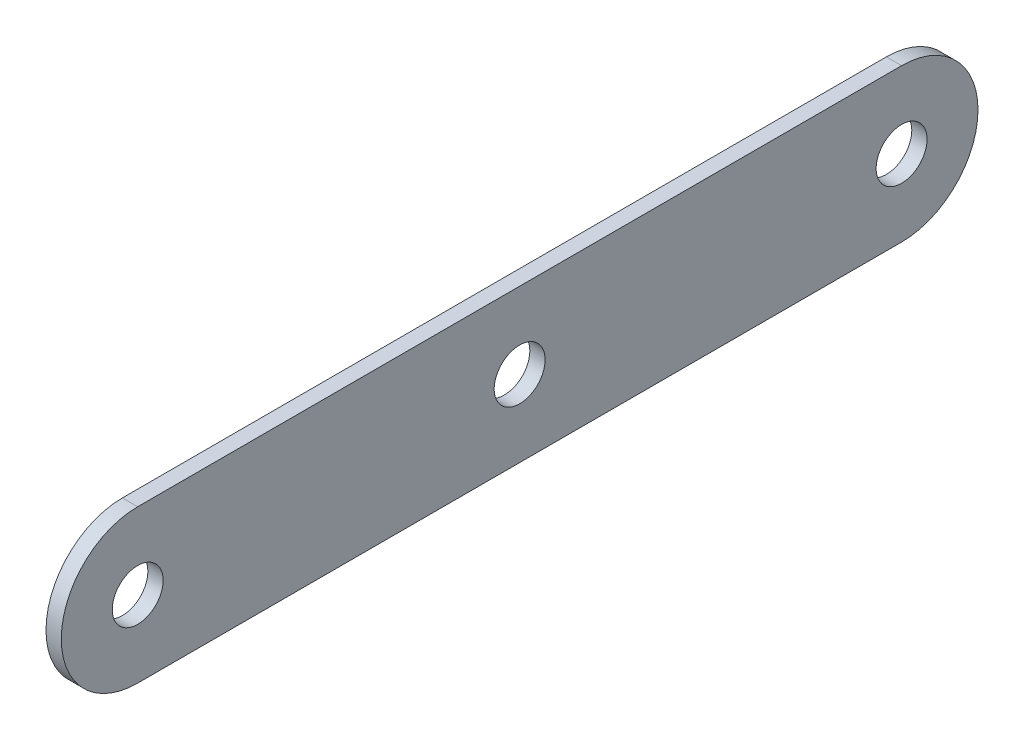
ISO-10303-21;
HEADER;
FILE_DESCRIPTION(('STEP AP214'),'2;1');
FILE_NAME('part.step','',(''),(''),'','','');
FILE_SCHEMA(('AUTOMOTIVE_DESIGN { 1 0 10303 214 1 1 1 1 }'));
ENDSEC;
DATA;
#1=APPLICATION_CONTEXT('core data for automotive mechanical design processes');
#2=APPLICATION_PROTOCOL_DEFINITION('international standard','automotive_design',2000,#1);
#3=PRODUCT_CONTEXT('',#1,'mechanical');
#4=PRODUCT('Part','Part','',(#3));
#5=PRODUCT_RELATED_PRODUCT_CATEGORY('part','',(#4));
#6=PRODUCT_DEFINITION_FORMATION('','',#4);
#7=PRODUCT_DEFINITION_CONTEXT('part definition',#1,'design');
#8=PRODUCT_DEFINITION('design','',#6,#7);
#9=PRODUCT_DEFINITION_SHAPE('','',#8);
#10=(LENGTH_UNIT() NAMED_UNIT(*) SI_UNIT(.MILLI.,.METRE.));
#11=(NAMED_UNIT(*) PLANE_ANGLE_UNIT() SI_UNIT($,.RADIAN.));
#12=(NAMED_UNIT(*) SI_UNIT($,.STERADIAN.) SOLID_ANGLE_UNIT());
#13=UNCERTAINTY_MEASURE_WITH_UNIT(LENGTH_MEASURE(1.E-05),#10,'distance_accuracy_value','');
#14=(GEOMETRIC_REPRESENTATION_CONTEXT(3) GLOBAL_UNCERTAINTY_ASSIGNED_CONTEXT((#13)) GLOBAL_UNIT_ASSIGNED_CONTEXT((#10,
#11,#12)) REPRESENTATION_CONTEXT('',''));
#15=CARTESIAN_POINT('',(0.,0.,0.));
#16=DIRECTION('',(0.,0.,1.));
#17=DIRECTION('',(1.,0.,0.));
#18=AXIS2_PLACEMENT_3D('',#15,#16,#17);
#19=CARTESIAN_POINT('',(3.,0.,75.));
#20=DIRECTION('',(1.,0.,0.));
#21=DIRECTION('',(0.,0.,-1.));
#22=AXIS2_PLACEMENT_3D('',#19,#20,#21);
#23=PLANE('',#22);
#24=CARTESIAN_POINT('',(3.,0.,0.));
#25=DIRECTION('',(1.,0.,0.));
#26=DIRECTION('',(0.,0.,-1.));
#27=AXIS2_PLACEMENT_3D('',#24,#25,#26);
#28=CIRCLE('',#27,5.00000000000002);
#29=CARTESIAN_POINT('',(3.,0.,-5.00000000000002));
#30=VERTEX_POINT('',#29);
#31=EDGE_CURVE('E114',#30,#30,#28,.T.);
#32=ORIENTED_EDGE('',*,*,#31,.F.);
#33=EDGE_LOOP('',(#32));
#34=FACE_BOUND('',#33,.T.);
#35=CARTESIAN_POINT('',(3.,0.,75.));
#36=DIRECTION('',(1.,0.,0.));
#37=DIRECTION('',(0.,0.,-1.));
#38=AXIS2_PLACEMENT_3D('',#35,#36,#37);
#39=CIRCLE('',#38,15.);
#40=CARTESIAN_POINT('',(3.,15.,75.));
#41=VERTEX_POINT('',#40);
#42=CARTESIAN_POINT('',(3.,-15.,75.));
#43=VERTEX_POINT('',#42);
#44=EDGE_CURVE('E84',#41,#43,#39,.T.);
#45=ORIENTED_EDGE('',*,*,#44,.T.);
#46=DIRECTION('',(0.,0.,-1.));
#47=VECTOR('',#46,1.);
#48=CARTESIAN_POINT('',(3.,-15.,75.));
#49=LINE('',#48,#47);
#50=CARTESIAN_POINT('',(3.,-15.,-75.));
#51=VERTEX_POINT('',#50);
#52=EDGE_CURVE('E79',#43,#51,#49,.T.);
#53=ORIENTED_EDGE('',*,*,#52,.T.);
#54=CARTESIAN_POINT('',(3.,0.,-75.));
#55=DIRECTION('',(1.,0.,0.));
#56=DIRECTION('',(0.,0.,-1.));
#57=AXIS2_PLACEMENT_3D('',#54,#55,#56);
#58=CIRCLE('',#57,15.);
#59=CARTESIAN_POINT('',(3.,15.,-75.));
#60=VERTEX_POINT('',#59);
#61=EDGE_CURVE('E82',#51,#60,#58,.T.);
#62=ORIENTED_EDGE('',*,*,#61,.T.);
#63=DIRECTION('',(0.,0.,1.));
#64=VECTOR('',#63,1.);
#65=CARTESIAN_POINT('',(3.,15.,75.));
#66=LINE('',#65,#64);
#67=EDGE_CURVE('E49',#60,#41,#66,.T.);
#68=ORIENTED_EDGE('',*,*,#67,.T.);
#69=EDGE_LOOP('',(#45,#53,#62,#68));
#70=FACE_BOUND('',#69,.T.);
#71=CARTESIAN_POINT('',(3.,0.,75.));
#72=DIRECTION('',(1.,0.,0.));
#73=DIRECTION('',(0.,0.,-1.));
#74=AXIS2_PLACEMENT_3D('',#71,#72,#73);
#75=CIRCLE('',#74,5.00000000000002);
#76=CARTESIAN_POINT('',(3.,0.,70.));
#77=VERTEX_POINT('',#76);
#78=EDGE_CURVE('E99',#77,#77,#75,.T.);
#79=ORIENTED_EDGE('',*,*,#78,.F.);
#80=EDGE_LOOP('',(#79));
#81=FACE_BOUND('',#80,.T.);
#82=CARTESIAN_POINT('',(3.,0.,-75.));
#83=DIRECTION('',(1.,0.,0.));
#84=DIRECTION('',(0.,0.,-1.));
#85=AXIS2_PLACEMENT_3D('',#82,#83,#84);
#86=CIRCLE('',#85,5.00000000000002);
#87=CARTESIAN_POINT('',(3.,0.,-80.));
#88=VERTEX_POINT('',#87);
#89=EDGE_CURVE('E120',#88,#88,#86,.T.);
#90=ORIENTED_EDGE('',*,*,#89,.F.);
#91=EDGE_LOOP('',(#90));
#92=FACE_BOUND('',#91,.T.);
#93=ADVANCED_FACE('F32',(#34,#70,#81,#92),#23,.T.);
#94=CARTESIAN_POINT('',(0.,0.,75.));
#95=DIRECTION('',(1.,0.,0.));
#96=DIRECTION('',(0.,0.,-1.));
#97=AXIS2_PLACEMENT_3D('',#94,#95,#96);
#98=PLANE('',#97);
#99=CARTESIAN_POINT('',(0.,0.,0.));
#100=DIRECTION('',(1.,0.,0.));
#101=DIRECTION('',(0.,0.,-1.));
#102=AXIS2_PLACEMENT_3D('',#99,#100,#101);
#103=CIRCLE('',#102,5.00000000000002);
#104=CARTESIAN_POINT('',(0.,0.,-5.00000000000002));
#105=VERTEX_POINT('',#104);
#106=EDGE_CURVE('E117',#105,#105,#103,.T.);
#107=ORIENTED_EDGE('',*,*,#106,.T.);
#108=EDGE_LOOP('',(#107));
#109=FACE_BOUND('',#108,.T.);
#110=CARTESIAN_POINT('',(0.,0.,75.));
#111=DIRECTION('',(1.,0.,0.));
#112=DIRECTION('',(0.,0.,-1.));
#113=AXIS2_PLACEMENT_3D('',#110,#111,#112);
#114=CIRCLE('',#113,15.);
#115=CARTESIAN_POINT('',(0.,15.,75.));
#116=VERTEX_POINT('',#115);
#117=CARTESIAN_POINT('',(0.,-15.,75.));
#118=VERTEX_POINT('',#117);
#119=EDGE_CURVE('E96',#116,#118,#114,.T.);
#120=ORIENTED_EDGE('',*,*,#119,.F.);
#121=DIRECTION('',(0.,0.,1.));
#122=VECTOR('',#121,1.);
#123=CARTESIAN_POINT('',(0.,15.,75.));
#124=LINE('',#123,#122);
#125=CARTESIAN_POINT('',(0.,15.,-75.));
#126=VERTEX_POINT('',#125);
#127=EDGE_CURVE('E72',#126,#116,#124,.T.);
#128=ORIENTED_EDGE('',*,*,#127,.F.);
#129=CARTESIAN_POINT('',(0.,0.,-75.));
#130=DIRECTION('',(1.,0.,0.));
#131=DIRECTION('',(0.,0.,-1.));
#132=AXIS2_PLACEMENT_3D('',#129,#130,#131);
#133=CIRCLE('',#132,15.);
#134=CARTESIAN_POINT('',(0.,-15.,-75.));
#135=VERTEX_POINT('',#134);
#136=EDGE_CURVE('E66',#135,#126,#133,.T.);
#137=ORIENTED_EDGE('',*,*,#136,.F.);
#138=DIRECTION('',(0.,0.,-1.));
#139=VECTOR('',#138,1.);
#140=CARTESIAN_POINT('',(0.,-15.,75.));
#141=LINE('',#140,#139);
#142=EDGE_CURVE('E88',#118,#135,#141,.T.);
#143=ORIENTED_EDGE('',*,*,#142,.F.);
#144=EDGE_LOOP('',(#120,#128,#137,#143));
#145=FACE_BOUND('',#144,.T.);
#146=CARTESIAN_POINT('',(0.,0.,75.));
#147=DIRECTION('',(1.,0.,0.));
#148=DIRECTION('',(0.,0.,-1.));
#149=AXIS2_PLACEMENT_3D('',#146,#147,#148);
#150=CIRCLE('',#149,5.00000000000002);
#151=CARTESIAN_POINT('',(0.,0.,70.));
#152=VERTEX_POINT('',#151);
#153=EDGE_CURVE('E111',#152,#152,#150,.T.);
#154=ORIENTED_EDGE('',*,*,#153,.T.);
#155=EDGE_LOOP('',(#154));
#156=FACE_BOUND('',#155,.T.);
#157=CARTESIAN_POINT('',(0.,0.,-75.));
#158=DIRECTION('',(1.,0.,0.));
#159=DIRECTION('',(0.,0.,-1.));
#160=AXIS2_PLACEMENT_3D('',#157,#158,#159);
#161=CIRCLE('',#160,5.00000000000002);
#162=CARTESIAN_POINT('',(0.,0.,-80.));
#163=VERTEX_POINT('',#162);
#164=EDGE_CURVE('E123',#163,#163,#161,.T.);
#165=ORIENTED_EDGE('',*,*,#164,.T.);
#166=EDGE_LOOP('',(#165));
#167=FACE_BOUND('',#166,.T.);
#168=ADVANCED_FACE('F107',(#109,#145,#156,#167),#98,.F.);
#169=CARTESIAN_POINT('',(3.,0.,75.));
#170=DIRECTION('',(-1.,0.,0.));
#171=DIRECTION('',(0.,0.,1.));
#172=AXIS2_PLACEMENT_3D('',#169,#170,#171);
#173=CYLINDRICAL_SURFACE('',#172,15.);
#174=ORIENTED_EDGE('',*,*,#119,.T.);
#175=DIRECTION('',(-1.,0.,0.));
#176=VECTOR('',#175,1.);
#177=CARTESIAN_POINT('',(3.,-15.,75.));
#178=LINE('',#177,#176);
#179=EDGE_CURVE('E11',#43,#118,#178,.T.);
#180=ORIENTED_EDGE('',*,*,#179,.F.);
#181=ORIENTED_EDGE('',*,*,#44,.F.);
#182=DIRECTION('',(-1.,0.,0.));
#183=VECTOR('',#182,1.);
#184=CARTESIAN_POINT('',(3.,15.,75.));
#185=LINE('',#184,#183);
#186=EDGE_CURVE('E92',#41,#116,#185,.T.);
#187=ORIENTED_EDGE('',*,*,#186,.T.);
#188=EDGE_LOOP('',(#174,#180,#181,#187));
#189=FACE_BOUND('',#188,.T.);
#190=ADVANCED_FACE('F34',(#189),#173,.T.);
#191=CARTESIAN_POINT('',(3.,-15.,75.));
#192=DIRECTION('',(0.,1.,0.));
#193=DIRECTION('',(0.,0.,1.));
#194=AXIS2_PLACEMENT_3D('',#191,#192,#193);
#195=PLANE('',#194);
#196=ORIENTED_EDGE('',*,*,#142,.T.);
#197=DIRECTION('',(-1.,0.,0.));
#198=VECTOR('',#197,1.);
#199=CARTESIAN_POINT('',(3.,-15.,-75.));
#200=LINE('',#199,#198);
#201=EDGE_CURVE('E41',#51,#135,#200,.T.);
#202=ORIENTED_EDGE('',*,*,#201,.F.);
#203=ORIENTED_EDGE('',*,*,#52,.F.);
#204=ORIENTED_EDGE('',*,*,#179,.T.);
#205=EDGE_LOOP('',(#196,#202,#203,#204));
#206=FACE_BOUND('',#205,.T.);
#207=ADVANCED_FACE('F87',(#206),#195,.F.);
#208=CARTESIAN_POINT('',(3.,0.,-75.));
#209=DIRECTION('',(-1.,0.,0.));
#210=DIRECTION('',(0.,0.,1.));
#211=AXIS2_PLACEMENT_3D('',#208,#209,#210);
#212=CYLINDRICAL_SURFACE('',#211,15.);
#213=ORIENTED_EDGE('',*,*,#136,.T.);
#214=DIRECTION('',(-1.,0.,0.));
#215=VECTOR('',#214,1.);
#216=CARTESIAN_POINT('',(3.,15.,-75.));
#217=LINE('',#216,#215);
#218=EDGE_CURVE('E89',#60,#126,#217,.T.);
#219=ORIENTED_EDGE('',*,*,#218,.F.);
#220=ORIENTED_EDGE('',*,*,#61,.F.);
#221=ORIENTED_EDGE('',*,*,#201,.T.);
#222=EDGE_LOOP('',(#213,#219,#220,#221));
#223=FACE_BOUND('',#222,.T.);
#224=ADVANCED_FACE('F90',(#223),#212,.T.);
#225=CARTESIAN_POINT('',(3.,15.,75.));
#226=DIRECTION('',(0.,-1.,0.));
#227=DIRECTION('',(0.,0.,-1.));
#228=AXIS2_PLACEMENT_3D('',#225,#226,#227);
#229=PLANE('',#228);
#230=ORIENTED_EDGE('',*,*,#127,.T.);
#231=ORIENTED_EDGE('',*,*,#186,.F.);
#232=ORIENTED_EDGE('',*,*,#67,.F.);
#233=ORIENTED_EDGE('',*,*,#218,.T.);
#234=EDGE_LOOP('',(#230,#231,#232,#233));
#235=FACE_BOUND('',#234,.T.);
#236=ADVANCED_FACE('F104',(#235),#229,.F.);
#237=CARTESIAN_POINT('',(3.,0.,75.));
#238=DIRECTION('',(-1.,0.,0.));
#239=DIRECTION('',(0.,0.,1.));
#240=AXIS2_PLACEMENT_3D('',#237,#238,#239);
#241=CYLINDRICAL_SURFACE('',#240,5.00000000000002);
#242=ORIENTED_EDGE('',*,*,#78,.T.);
#243=EDGE_LOOP('',(#242));
#244=FACE_BOUND('',#243,.T.);
#245=ORIENTED_EDGE('',*,*,#153,.F.);
#246=EDGE_LOOP('',(#245));
#247=FACE_BOUND('',#246,.T.);
#248=ADVANCED_FACE('F142',(#244,#247),#241,.F.);
#249=CARTESIAN_POINT('',(3.,0.,0.));
#250=DIRECTION('',(-1.,0.,0.));
#251=DIRECTION('',(0.,0.,1.));
#252=AXIS2_PLACEMENT_3D('',#249,#250,#251);
#253=CYLINDRICAL_SURFACE('',#252,5.00000000000002);
#254=ORIENTED_EDGE('',*,*,#31,.T.);
#255=EDGE_LOOP('',(#254));
#256=FACE_BOUND('',#255,.T.);
#257=ORIENTED_EDGE('',*,*,#106,.F.);
#258=EDGE_LOOP('',(#257));
#259=FACE_BOUND('',#258,.T.);
#260=ADVANCED_FACE('F188',(#256,#259),#253,.F.);
#261=CARTESIAN_POINT('',(3.,0.,-75.));
#262=DIRECTION('',(-1.,0.,0.));
#263=DIRECTION('',(0.,0.,1.));
#264=AXIS2_PLACEMENT_3D('',#261,#262,#263);
#265=CYLINDRICAL_SURFACE('',#264,5.00000000000002);
#266=ORIENTED_EDGE('',*,*,#89,.T.);
#267=EDGE_LOOP('',(#266));
#268=FACE_BOUND('',#267,.T.);
#269=ORIENTED_EDGE('',*,*,#164,.F.);
#270=EDGE_LOOP('',(#269));
#271=FACE_BOUND('',#270,.T.);
#272=ADVANCED_FACE('F129',(#268,#271),#265,.F.);
#273=CLOSED_SHELL('',(#93,#168,#190,#207,#224,#236,#248,#260,#272));
#274=MANIFOLD_SOLID_BREP('B2',#273);
#275=ADVANCED_BREP_SHAPE_REPRESENTATION('',(#18,#274),#14);
#276=SHAPE_DEFINITION_REPRESENTATION(#9,#275);
ENDSEC;
END-ISO-10303-21;
